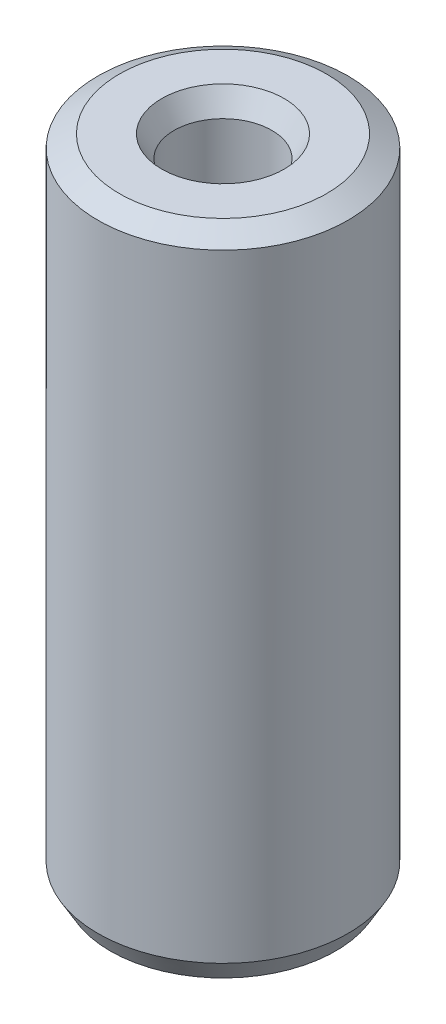
ISO-10303-21;
HEADER;
FILE_DESCRIPTION(('STEP AP214'),'2;1');
FILE_NAME('part.step','',(''),(''),'','','');
FILE_SCHEMA(('AUTOMOTIVE_DESIGN { 1 0 10303 214 1 1 1 1 }'));
ENDSEC;
DATA;
#1=APPLICATION_CONTEXT('core data for automotive mechanical design processes');
#2=APPLICATION_PROTOCOL_DEFINITION('international standard','automotive_design',2000,#1);
#3=PRODUCT_CONTEXT('',#1,'mechanical');
#4=PRODUCT('Part','Part','',(#3));
#5=PRODUCT_RELATED_PRODUCT_CATEGORY('part','',(#4));
#6=PRODUCT_DEFINITION_FORMATION('','',#4);
#7=PRODUCT_DEFINITION_CONTEXT('part definition',#1,'design');
#8=PRODUCT_DEFINITION('design','',#6,#7);
#9=PRODUCT_DEFINITION_SHAPE('','',#8);
#10=(LENGTH_UNIT() NAMED_UNIT(*) SI_UNIT(.MILLI.,.METRE.));
#11=(NAMED_UNIT(*) PLANE_ANGLE_UNIT() SI_UNIT($,.RADIAN.));
#12=(NAMED_UNIT(*) SI_UNIT($,.STERADIAN.) SOLID_ANGLE_UNIT());
#13=UNCERTAINTY_MEASURE_WITH_UNIT(LENGTH_MEASURE(1.E-05),#10,'distance_accuracy_value','');
#14=(GEOMETRIC_REPRESENTATION_CONTEXT(3) GLOBAL_UNCERTAINTY_ASSIGNED_CONTEXT((#13)) GLOBAL_UNIT_ASSIGNED_CONTEXT((#10,
#11,#12)) REPRESENTATION_CONTEXT('',''));
#15=CARTESIAN_POINT('',(0.,0.,0.));
#16=DIRECTION('',(0.,0.,1.));
#17=DIRECTION('',(1.,0.,0.));
#18=AXIS2_PLACEMENT_3D('',#15,#16,#17);
#19=CARTESIAN_POINT('',(0.,169.29034253447,0.));
#20=DIRECTION('',(0.,-1.,0.));
#21=DIRECTION('',(0.,0.,-1.));
#22=AXIS2_PLACEMENT_3D('',#19,#20,#21);
#23=CYLINDRICAL_SURFACE('',#22,32.5);
#24=CARTESIAN_POINT('',(0.,5.56356924317253,0.));
#25=DIRECTION('',(0.,1.,0.));
#26=DIRECTION('',(0.,0.,1.));
#27=AXIS2_PLACEMENT_3D('',#24,#25,#26);
#28=CIRCLE('',#27,32.5);
#29=CARTESIAN_POINT('',(0.,5.56356924317253,32.5));
#30=VERTEX_POINT('',#29);
#31=EDGE_CURVE('E10',#30,#30,#28,.T.);
#32=ORIENTED_EDGE('',*,*,#31,.T.);
#33=EDGE_LOOP('',(#32));
#34=FACE_BOUND('',#33,.T.);
#35=CARTESIAN_POINT('',(0.,166.078214334269,0.));
#36=DIRECTION('',(0.,1.,0.));
#37=DIRECTION('',(0.,0.,1.));
#38=AXIS2_PLACEMENT_3D('',#35,#36,#37);
#39=CIRCLE('',#38,32.5);
#40=CARTESIAN_POINT('',(0.,166.078214334269,-32.5));
#41=VERTEX_POINT('',#40);
#42=EDGE_CURVE('E50',#41,#41,#39,.F.);
#43=ORIENTED_EDGE('',*,*,#42,.T.);
#44=EDGE_LOOP('',(#43));
#45=FACE_BOUND('',#44,.T.);
#46=ADVANCED_FACE('F39',(#34,#45),#23,.T.);
#47=CARTESIAN_POINT('',(0.,169.29034253447,0.));
#48=DIRECTION('',(0.,1.,0.));
#49=DIRECTION('',(0.,0.,1.));
#50=AXIS2_PLACEMENT_3D('',#47,#48,#49);
#51=PLANE('',#50);
#52=CARTESIAN_POINT('',(0.,169.29034253447,0.));
#53=DIRECTION('',(0.,1.,0.));
#54=DIRECTION('',(0.,0.,1.));
#55=AXIS2_PLACEMENT_3D('',#52,#53,#54);
#56=CIRCLE('',#55,15.9118404800609);
#57=CARTESIAN_POINT('',(0.,169.29034253447,15.9118404800609));
#58=VERTEX_POINT('',#57);
#59=EDGE_CURVE('E58',#58,#58,#56,.F.);
#60=ORIENTED_EDGE('',*,*,#59,.T.);
#61=EDGE_LOOP('',(#60));
#62=FACE_BOUND('',#61,.T.);
#63=CARTESIAN_POINT('',(0.,169.29034253447,0.));
#64=DIRECTION('',(0.,1.,0.));
#65=DIRECTION('',(0.,0.,1.));
#66=AXIS2_PLACEMENT_3D('',#63,#64,#65);
#67=CIRCLE('',#66,26.9364307568276);
#68=CARTESIAN_POINT('',(0.,169.29034253447,-26.9364307568276));
#69=VERTEX_POINT('',#68);
#70=EDGE_CURVE('E61',#69,#69,#67,.T.);
#71=ORIENTED_EDGE('',*,*,#70,.T.);
#72=EDGE_LOOP('',(#71));
#73=FACE_BOUND('',#72,.T.);
#74=ADVANCED_FACE('F88',(#62,#73),#51,.T.);
#75=CARTESIAN_POINT('',(0.,0.,0.));
#76=DIRECTION('',(0.,1.,0.));
#77=DIRECTION('',(0.,0.,1.));
#78=AXIS2_PLACEMENT_3D('',#75,#76,#77);
#79=PLANE('',#78);
#80=CARTESIAN_POINT('',(0.,0.,0.));
#81=DIRECTION('',(0.,1.,0.));
#82=DIRECTION('',(0.,0.,1.));
#83=AXIS2_PLACEMENT_3D('',#80,#81,#82);
#84=CIRCLE('',#83,18.2632815230327);
#85=CARTESIAN_POINT('',(0.,0.,18.2632815230327));
#86=VERTEX_POINT('',#85);
#87=EDGE_CURVE('E51',#86,#86,#84,.T.);
#88=ORIENTED_EDGE('',*,*,#87,.T.);
#89=EDGE_LOOP('',(#88));
#90=FACE_BOUND('',#89,.T.);
#91=CARTESIAN_POINT('',(0.,0.,0.));
#92=DIRECTION('',(0.,1.,0.));
#93=DIRECTION('',(0.,0.,1.));
#94=AXIS2_PLACEMENT_3D('',#91,#92,#93);
#95=CIRCLE('',#94,29.2878717997992);
#96=CARTESIAN_POINT('',(0.,0.,29.2878717997992));
#97=VERTEX_POINT('',#96);
#98=EDGE_CURVE('E54',#97,#97,#95,.F.);
#99=ORIENTED_EDGE('',*,*,#98,.T.);
#100=EDGE_LOOP('',(#99));
#101=FACE_BOUND('',#100,.T.);
#102=ADVANCED_FACE('F83',(#90,#101),#79,.F.);
#103=CARTESIAN_POINT('',(0.,169.29034253447,0.));
#104=DIRECTION('',(0.,-1.,0.));
#105=DIRECTION('',(0.,0.,-1.));
#106=AXIS2_PLACEMENT_3D('',#103,#104,#105);
#107=CYLINDRICAL_SURFACE('',#106,12.6997122798602);
#108=CARTESIAN_POINT('',(0.,163.726773291298,0.));
#109=DIRECTION('',(0.,1.,0.));
#110=DIRECTION('',(0.,0.,1.));
#111=AXIS2_PLACEMENT_3D('',#108,#109,#110);
#112=CIRCLE('',#111,12.6997122798602);
#113=CARTESIAN_POINT('',(0.,163.726773291298,12.6997122798602));
#114=VERTEX_POINT('',#113);
#115=EDGE_CURVE('E67',#114,#114,#112,.T.);
#116=ORIENTED_EDGE('',*,*,#115,.T.);
#117=EDGE_LOOP('',(#116));
#118=FACE_BOUND('',#117,.T.);
#119=CARTESIAN_POINT('',(0.,3.21212820020078,0.));
#120=DIRECTION('',(0.,1.,0.));
#121=DIRECTION('',(0.,0.,1.));
#122=AXIS2_PLACEMENT_3D('',#119,#120,#121);
#123=CIRCLE('',#122,12.6997122798602);
#124=CARTESIAN_POINT('',(0.,3.21212820020078,12.6997122798602));
#125=VERTEX_POINT('',#124);
#126=EDGE_CURVE('E69',#125,#125,#123,.F.);
#127=ORIENTED_EDGE('',*,*,#126,.T.);
#128=EDGE_LOOP('',(#127));
#129=FACE_BOUND('',#128,.T.);
#130=ADVANCED_FACE('F71',(#118,#129),#107,.F.);
#131=CARTESIAN_POINT('',(0.,163.726773291298,0.));
#132=DIRECTION('',(0.,1.,0.));
#133=DIRECTION('',(0.,0.,1.));
#134=AXIS2_PLACEMENT_3D('',#131,#132,#133);
#135=CONICAL_SURFACE('',#134,12.6997122798602,0.523598775598299);
#136=ORIENTED_EDGE('',*,*,#59,.F.);
#137=EDGE_LOOP('',(#136));
#138=FACE_BOUND('',#137,.T.);
#139=ORIENTED_EDGE('',*,*,#115,.F.);
#140=EDGE_LOOP('',(#139));
#141=FACE_BOUND('',#140,.T.);
#142=ADVANCED_FACE('F77',(#138,#141),#135,.F.);
#143=CARTESIAN_POINT('',(0.,0.,0.));
#144=DIRECTION('',(0.,-1.,0.));
#145=DIRECTION('',(0.,0.,-1.));
#146=AXIS2_PLACEMENT_3D('',#143,#144,#145);
#147=CONICAL_SURFACE('',#146,18.2632815230327,1.0471975511966);
#148=ORIENTED_EDGE('',*,*,#126,.F.);
#149=EDGE_LOOP('',(#148));
#150=FACE_BOUND('',#149,.T.);
#151=ORIENTED_EDGE('',*,*,#87,.F.);
#152=EDGE_LOOP('',(#151));
#153=FACE_BOUND('',#152,.T.);
#154=ADVANCED_FACE('F73',(#150,#153),#147,.F.);
#155=CARTESIAN_POINT('',(0.,5.56356924317253,0.));
#156=DIRECTION('',(0.,1.,0.));
#157=DIRECTION('',(0.,0.,1.));
#158=AXIS2_PLACEMENT_3D('',#155,#156,#157);
#159=CONICAL_SURFACE('',#158,32.5,0.523598775598303);
#160=ORIENTED_EDGE('',*,*,#98,.F.);
#161=EDGE_LOOP('',(#160));
#162=FACE_BOUND('',#161,.T.);
#163=ORIENTED_EDGE('',*,*,#31,.F.);
#164=EDGE_LOOP('',(#163));
#165=FACE_BOUND('',#164,.T.);
#166=ADVANCED_FACE('F76',(#162,#165),#159,.T.);
#167=CARTESIAN_POINT('',(0.,169.29034253447,0.));
#168=DIRECTION('',(0.,-1.,0.));
#169=DIRECTION('',(0.,0.,-1.));
#170=AXIS2_PLACEMENT_3D('',#167,#168,#169);
#171=CONICAL_SURFACE('',#170,26.9364307568276,1.04719755119659);
#172=CARTESIAN_POINT('',(0.,166.078214334269,-32.5));
#173=CARTESIAN_POINT('',(0.,166.111674003021,-32.442046153717));
#174=CARTESIAN_POINT('',(0.,166.145133671773,-32.3840923074339));
#175=CARTESIAN_POINT('',(0.,166.212053009278,-32.2681846148678));
#176=CARTESIAN_POINT('',(0.,166.24551267803,-32.2102307685848));
#177=CARTESIAN_POINT('',(0.,166.312432015534,-32.0943230760187));
#178=CARTESIAN_POINT('',(0.,166.345891684286,-32.0363692297357));
#179=CARTESIAN_POINT('',(0.,166.41281102179,-31.9204615371696));
#180=CARTESIAN_POINT('',(0.,166.446270690542,-31.8625076908865));
#181=CARTESIAN_POINT('',(0.,166.513190028046,-31.7465999983204));
#182=CARTESIAN_POINT('',(0.,166.546649696799,-31.6886461520374));
#183=CARTESIAN_POINT('',(0.,166.613569034303,-31.5727384594713));
#184=CARTESIAN_POINT('',(0.,166.647028703055,-31.5147846131882));
#185=CARTESIAN_POINT('',(0.,166.713948040559,-31.3988769206222));
#186=CARTESIAN_POINT('',(0.,166.747407709311,-31.3409230743391));
#187=CARTESIAN_POINT('',(0.,166.814327046815,-31.225015381773));
#188=CARTESIAN_POINT('',(0.,166.847786715567,-31.16706153549));
#189=CARTESIAN_POINT('',(0.,166.914706053072,-31.0511538429239));
#190=CARTESIAN_POINT('',(0.,166.948165721824,-30.9931999966408));
#191=CARTESIAN_POINT('',(0.,167.015085059328,-30.8772923040747));
#192=CARTESIAN_POINT('',(0.,167.04854472808,-30.8193384577917));
#193=CARTESIAN_POINT('',(0.,167.115464065584,-30.7034307652256));
#194=CARTESIAN_POINT('',(0.,167.148923734336,-30.6454769189426));
#195=CARTESIAN_POINT('',(0.,167.21584307184,-30.5295692263765));
#196=CARTESIAN_POINT('',(0.,167.249302740592,-30.4716153800934));
#197=CARTESIAN_POINT('',(0.,167.316222078097,-30.3557076875273));
#198=CARTESIAN_POINT('',(0.,167.349681746849,-30.2977538412443));
#199=CARTESIAN_POINT('',(0.,167.416601084353,-30.1818461486782));
#200=CARTESIAN_POINT('',(0.,167.450060753105,-30.1238923023951));
#201=CARTESIAN_POINT('',(0.,167.516980090609,-30.007984609829));
#202=CARTESIAN_POINT('',(0.,167.550439759361,-29.950030763546));
#203=CARTESIAN_POINT('',(0.,167.617359096865,-29.8341230709799));
#204=CARTESIAN_POINT('',(0.,167.650818765618,-29.7761692246969));
#205=CARTESIAN_POINT('',(0.,167.717738103122,-29.6602615321308));
#206=CARTESIAN_POINT('',(0.,167.751197771874,-29.6023076858477));
#207=CARTESIAN_POINT('',(0.,167.818117109378,-29.4863999932816));
#208=CARTESIAN_POINT('',(0.,167.85157677813,-29.4284461469986));
#209=CARTESIAN_POINT('',(0.,167.918496115634,-29.3125384544325));
#210=CARTESIAN_POINT('',(0.,167.951955784386,-29.2545846081494));
#211=CARTESIAN_POINT('',(0.,168.018875121891,-29.1386769155834));
#212=CARTESIAN_POINT('',(0.,168.052334790643,-29.0807230693003));
#213=CARTESIAN_POINT('',(0.,168.119254128147,-28.9648153767342));
#214=CARTESIAN_POINT('',(0.,168.152713796899,-28.9068615304512));
#215=CARTESIAN_POINT('',(0.,168.219633134403,-28.7909538378851));
#216=CARTESIAN_POINT('',(0.,168.253092803155,-28.732999991602));
#217=CARTESIAN_POINT('',(0.,168.320012140659,-28.6170922990359));
#218=CARTESIAN_POINT('',(0.,168.353471809411,-28.5591384527529));
#219=CARTESIAN_POINT('',(0.,168.420391146916,-28.4432307601868));
#220=CARTESIAN_POINT('',(0.,168.453850815668,-28.3852769139038));
#221=CARTESIAN_POINT('',(0.,168.520770153172,-28.2693692213377));
#222=CARTESIAN_POINT('',(0.,168.554229821924,-28.2114153750546));
#223=CARTESIAN_POINT('',(0.,168.621149159428,-28.0955076824885));
#224=CARTESIAN_POINT('',(0.,168.65460882818,-28.0375538362055));
#225=CARTESIAN_POINT('',(0.,168.721528165684,-27.9216461436394));
#226=CARTESIAN_POINT('',(0.,168.754987834437,-27.8636922973563));
#227=CARTESIAN_POINT('',(0.,168.821907171941,-27.7477846047903));
#228=CARTESIAN_POINT('',(0.,168.855366840693,-27.6898307585072));
#229=CARTESIAN_POINT('',(0.,168.922286178197,-27.5739230659411));
#230=CARTESIAN_POINT('',(0.,168.955745846949,-27.5159692196581));
#231=CARTESIAN_POINT('',(0.,169.022665184453,-27.400061527092));
#232=CARTESIAN_POINT('',(0.,169.056124853205,-27.3421076808089));
#233=CARTESIAN_POINT('',(0.,169.12304419071,-27.2261999882428));
#234=CARTESIAN_POINT('',(0.,169.156503859462,-27.1682461419598));
#235=CARTESIAN_POINT('',(0.,169.223423196966,-27.0523384493937));
#236=CARTESIAN_POINT('',(0.,169.256882865718,-26.9943846031107));
#237=CARTESIAN_POINT('',(0.,169.29034253447,-26.9364307568276));
#238=B_SPLINE_CURVE_WITH_KNOTS('',3,(#172,#173,#174,#175,#176,#177,#178,#179,#180,#181,#182,
#183,#184,#185,#186,#187,#188,#189,#190,#191,#192,#193,#194,#195,#196,#197,#198,#199,#200,#201,
#202,#203,#204,#205,#206,#207,#208,#209,#210,#211,#212,#213,#214,#215,#216,#217,#218,#219,#220,
#221,#222,#223,#224,#225,#226,#227,#228,#229,#230,#231,#232,#233,#234,#235,#236,#237),
.UNSPECIFIED.,.F.,.F.,(4,2,2,2,2,2,2,2,2,2,2,2,2,2,2,2,2,2,2,2,2,2,2,2,2,2,2,2,2,2,2,2,4),(0.,
0.200758012512542,0.401516025025091,0.602274037537627,0.803032050050182,1.00379006256272,
1.20454807507527,1.40530608758782,1.60606410010036,1.80682211261291,2.00758012512544,
2.208338137638,2.40909615015055,2.60985416266309,2.81061217517563,3.01137018768817,
3.21212820020072,3.41288621271328,3.61364422522581,3.81440223773836,4.0151602502509,
4.21591826276345,4.416676275276,4.61743428778854,4.81819230030109,5.01895031281363,
5.21970832532618,5.42046633783873,5.62122435035127,5.82198236286382,6.02274037537635,
6.22349838788891,6.42425640040146),.UNSPECIFIED.);
#239=EDGE_CURVE('BSEAM45',#41,#69,#238,.T.);
#240=ORIENTED_EDGE('',*,*,#42,.F.);
#241=ORIENTED_EDGE('',*,*,#70,.F.);
#242=ORIENTED_EDGE('',*,*,#239,.T.);
#243=ORIENTED_EDGE('',*,*,#239,.F.);
#244=EDGE_LOOP('',(#240,#242,#241,#243));
#245=FACE_BOUND('',#244,.T.);
#246=ADVANCED_FACE('F45',(#245),#171,.T.);
#247=CLOSED_SHELL('',(#46,#74,#102,#130,#142,#154,#166,#246));
#248=MANIFOLD_SOLID_BREP('B2',#247);
#249=ADVANCED_BREP_SHAPE_REPRESENTATION('',(#18,#248),#14);
#250=SHAPE_DEFINITION_REPRESENTATION(#9,#249);
ENDSEC;
END-ISO-10303-21;
